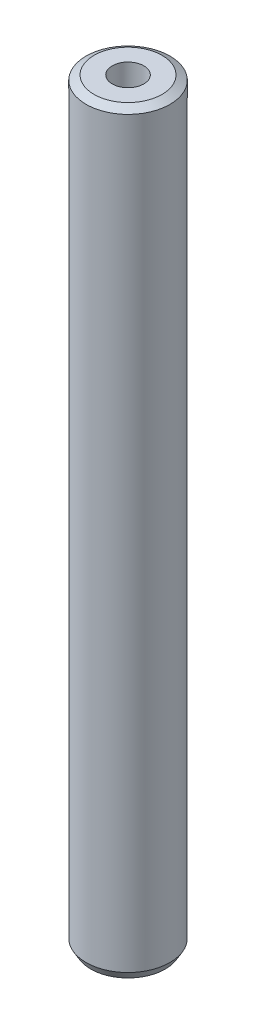
ISO-10303-21;
HEADER;
FILE_DESCRIPTION(('STEP AP214'),'2;1');
FILE_NAME('part.step','',(''),(''),'','','');
FILE_SCHEMA(('AUTOMOTIVE_DESIGN { 1 0 10303 214 1 1 1 1 }'));
ENDSEC;
DATA;
#1=APPLICATION_CONTEXT('core data for automotive mechanical design processes');
#2=APPLICATION_PROTOCOL_DEFINITION('international standard','automotive_design',2000,#1);
#3=PRODUCT_CONTEXT('',#1,'mechanical');
#4=PRODUCT('Part','Part','',(#3));
#5=PRODUCT_RELATED_PRODUCT_CATEGORY('part','',(#4));
#6=PRODUCT_DEFINITION_FORMATION('','',#4);
#7=PRODUCT_DEFINITION_CONTEXT('part definition',#1,'design');
#8=PRODUCT_DEFINITION('design','',#6,#7);
#9=PRODUCT_DEFINITION_SHAPE('','',#8);
#10=(LENGTH_UNIT() NAMED_UNIT(*) SI_UNIT(.MILLI.,.METRE.));
#11=(NAMED_UNIT(*) PLANE_ANGLE_UNIT() SI_UNIT($,.RADIAN.));
#12=(NAMED_UNIT(*) SI_UNIT($,.STERADIAN.) SOLID_ANGLE_UNIT());
#13=UNCERTAINTY_MEASURE_WITH_UNIT(LENGTH_MEASURE(1.E-05),#10,'distance_accuracy_value','');
#14=(GEOMETRIC_REPRESENTATION_CONTEXT(3) GLOBAL_UNCERTAINTY_ASSIGNED_CONTEXT((#13)) GLOBAL_UNIT_ASSIGNED_CONTEXT((#10,
#11,#12)) REPRESENTATION_CONTEXT('',''));
#15=CARTESIAN_POINT('',(0.,0.,0.));
#16=DIRECTION('',(0.,0.,1.));
#17=DIRECTION('',(1.,0.,0.));
#18=AXIS2_PLACEMENT_3D('',#15,#16,#17);
#19=CARTESIAN_POINT('',(0.,180.282610110916,0.));
#20=DIRECTION('',(0.,-1.,0.));
#21=DIRECTION('',(0.,0.,-1.));
#22=AXIS2_PLACEMENT_3D('',#19,#20,#21);
#23=CYLINDRICAL_SURFACE('',#22,10.);
#24=CARTESIAN_POINT('',(0.,179.183587360604,0.));
#25=DIRECTION('',(0.,1.,0.));
#26=DIRECTION('',(0.,0.,1.));
#27=AXIS2_PLACEMENT_3D('',#24,#25,#26);
#28=CIRCLE('',#27,10.);
#29=CARTESIAN_POINT('',(0.,179.183587360604,-10.));
#30=VERTEX_POINT('',#29);
#31=EDGE_CURVE('E50',#30,#30,#28,.F.);
#32=CARTESIAN_POINT('',(0.,1.9035632422148,0.));
#33=DIRECTION('',(0.,1.,0.));
#34=DIRECTION('',(0.,0.,1.));
#35=AXIS2_PLACEMENT_3D('',#32,#33,#34);
#36=CIRCLE('',#35,10.);
#37=CARTESIAN_POINT('',(0.,1.9035632422148,-10.));
#38=VERTEX_POINT('',#37);
#39=EDGE_CURVE('E51',#38,#38,#36,.T.);
#40=CARTESIAN_POINT('',(0.,179.183587360604,-10.));
#41=CARTESIAN_POINT('',(0.,177.336920442704,-10.));
#42=CARTESIAN_POINT('',(0.,175.490253524804,-10.));
#43=CARTESIAN_POINT('',(0.,171.796919689005,-10.));
#44=CARTESIAN_POINT('',(0.,169.950252771105,-10.));
#45=CARTESIAN_POINT('',(0.,166.256918935305,-10.));
#46=CARTESIAN_POINT('',(0.,164.410252017405,-10.));
#47=CARTESIAN_POINT('',(0.,160.716918181605,-10.));
#48=CARTESIAN_POINT('',(0.,158.870251263705,-10.));
#49=CARTESIAN_POINT('',(0.,155.176917427906,-10.));
#50=CARTESIAN_POINT('',(0.,153.330250510006,-10.));
#51=CARTESIAN_POINT('',(0.,149.636916674206,-10.));
#52=CARTESIAN_POINT('',(0.,147.790249756306,-10.));
#53=CARTESIAN_POINT('',(0.,144.096915920506,-10.));
#54=CARTESIAN_POINT('',(0.,142.250249002606,-10.));
#55=CARTESIAN_POINT('',(0.,138.556915166807,-10.));
#56=CARTESIAN_POINT('',(0.,136.710248248907,-10.));
#57=CARTESIAN_POINT('',(0.,133.016914413107,-10.));
#58=CARTESIAN_POINT('',(0.,131.170247495207,-10.));
#59=CARTESIAN_POINT('',(0.,127.476913659407,-10.));
#60=CARTESIAN_POINT('',(0.,125.630246741507,-10.));
#61=CARTESIAN_POINT('',(0.,121.936912905708,-10.));
#62=CARTESIAN_POINT('',(0.,120.090245987808,-10.));
#63=CARTESIAN_POINT('',(0.,116.396912152008,-10.));
#64=CARTESIAN_POINT('',(0.,114.550245234108,-10.));
#65=CARTESIAN_POINT('',(0.,110.856911398308,-10.));
#66=CARTESIAN_POINT('',(0.,109.010244480408,-10.));
#67=CARTESIAN_POINT('',(0.,105.316910644609,-10.));
#68=CARTESIAN_POINT('',(0.,103.470243726709,-10.));
#69=CARTESIAN_POINT('',(0.,99.7769098909089,-10.));
#70=CARTESIAN_POINT('',(0.,97.930242973009,-10.));
#71=CARTESIAN_POINT('',(0.,94.2369091372092,-10.));
#72=CARTESIAN_POINT('',(0.,92.3902422193093,-10.));
#73=CARTESIAN_POINT('',(0.,88.6969083835096,-10.));
#74=CARTESIAN_POINT('',(0.,86.8502414656097,-10.));
#75=CARTESIAN_POINT('',(0.,83.1569076298099,-10.));
#76=CARTESIAN_POINT('',(0.,81.31024071191,-10.));
#77=CARTESIAN_POINT('',(0.,77.6169068761102,-10.));
#78=CARTESIAN_POINT('',(0.,75.7702399582103,-10.));
#79=CARTESIAN_POINT('',(0.,72.0769061224105,-10.));
#80=CARTESIAN_POINT('',(0.,70.2302392045107,-10.));
#81=CARTESIAN_POINT('',(0.,66.5369053687109,-10.));
#82=CARTESIAN_POINT('',(0.,64.690238450811,-10.));
#83=CARTESIAN_POINT('',(0.,60.9969046150112,-10.));
#84=CARTESIAN_POINT('',(0.,59.1502376971113,-10.));
#85=CARTESIAN_POINT('',(0.,55.4569038613116,-10.));
#86=CARTESIAN_POINT('',(0.,53.6102369434117,-10.));
#87=CARTESIAN_POINT('',(0.,49.9169031076119,-10.));
#88=CARTESIAN_POINT('',(0.,48.070236189712,-10.));
#89=CARTESIAN_POINT('',(0.,44.3769023539122,-10.));
#90=CARTESIAN_POINT('',(0.,42.5302354360123,-10.));
#91=CARTESIAN_POINT('',(0.,38.8369016002126,-10.));
#92=CARTESIAN_POINT('',(0.,36.9902346823127,-10.));
#93=CARTESIAN_POINT('',(0.,33.2969008465129,-10.));
#94=CARTESIAN_POINT('',(0.,31.450233928613,-10.));
#95=CARTESIAN_POINT('',(0.,27.7569000928132,-10.));
#96=CARTESIAN_POINT('',(0.,25.9102331749133,-10.));
#97=CARTESIAN_POINT('',(0.,22.2168993391136,-10.));
#98=CARTESIAN_POINT('',(0.,20.3702324212137,-10.));
#99=CARTESIAN_POINT('',(0.,16.6768985854139,-10.));
#100=CARTESIAN_POINT('',(0.,14.830231667514,-10.));
#101=CARTESIAN_POINT('',(0.,11.1368978317142,-10.));
#102=CARTESIAN_POINT('',(0.,9.29023091381436,-10.));
#103=CARTESIAN_POINT('',(0.,5.59689707801458,-10.));
#104=CARTESIAN_POINT('',(0.,3.75023016011469,-10.));
#105=CARTESIAN_POINT('',(0.,1.9035632422148,-10.));
#106=B_SPLINE_CURVE_WITH_KNOTS('',3,(#40,#41,#42,#43,#44,#45,#46,#47,#48,#49,#50,#51,#52,#53,
#54,#55,#56,#57,#58,#59,#60,#61,#62,#63,#64,#65,#66,#67,#68,#69,#70,#71,#72,#73,#74,#75,#76,#77,
#78,#79,#80,#81,#82,#83,#84,#85,#86,#87,#88,#89,#90,#91,#92,#93,#94,#95,#96,#97,#98,#99,#100,
#101,#102,#103,#104,#105),.UNSPECIFIED.,.F.,.F.,(4,2,2,2,2,2,2,2,2,2,2,2,2,2,2,2,2,2,2,2,2,2,2,
2,2,2,2,2,2,2,2,2,4),(0.,5.54000075369965,11.0800015073993,16.620002261099,22.1600030147986,
27.7000037684983,33.240004522198,38.7800052758976,44.3200060295973,49.860006783297,
55.4000075369966,60.9400082906963,66.480009044396,72.0200097980956,77.5600105517953,
83.1000113054949,88.6400120591946,94.1800128128943,99.7200135665939,105.260014320294,
110.800015073993,116.340015827693,121.880016581393,127.420017335092,132.960018088792,
138.500018842492,144.040019596191,149.580020349891,155.120021103591,160.66002185729,
166.20002261099,171.74002336469,177.280024118389),.UNSPECIFIED.);
#107=EDGE_CURVE('BSEAM39',#30,#38,#106,.T.);
#108=ORIENTED_EDGE('',*,*,#31,.T.);
#109=ORIENTED_EDGE('',*,*,#39,.T.);
#110=ORIENTED_EDGE('',*,*,#107,.T.);
#111=ORIENTED_EDGE('',*,*,#107,.F.);
#112=EDGE_LOOP('',(#108,#110,#109,#111));
#113=FACE_BOUND('',#112,.T.);
#114=ADVANCED_FACE('F39',(#113),#23,.T.);
#115=CARTESIAN_POINT('',(0.,180.282610110916,0.));
#116=DIRECTION('',(0.,1.,0.));
#117=DIRECTION('',(0.,0.,1.));
#118=AXIS2_PLACEMENT_3D('',#115,#116,#117);
#119=PLANE('',#118);
#120=CARTESIAN_POINT('',(0.,180.282610110916,0.));
#121=DIRECTION('',(0.,1.,0.));
#122=DIRECTION('',(0.,0.,1.));
#123=AXIS2_PLACEMENT_3D('',#120,#121,#122);
#124=CIRCLE('',#123,8.09643675778579);
#125=CARTESIAN_POINT('',(0.,180.282610110916,8.09643675778579));
#126=VERTEX_POINT('',#125);
#127=EDGE_CURVE('E54',#126,#126,#124,.T.);
#128=ORIENTED_EDGE('',*,*,#127,.T.);
#129=EDGE_LOOP('',(#128));
#130=FACE_BOUND('',#129,.T.);
#131=CARTESIAN_POINT('',(0.,180.282610110916,0.));
#132=DIRECTION('',(0.,1.,0.));
#133=DIRECTION('',(0.,0.,1.));
#134=AXIS2_PLACEMENT_3D('',#131,#132,#133);
#135=CIRCLE('',#134,3.75968000644299);
#136=CARTESIAN_POINT('',(0.,180.282610110916,-3.75968000644299));
#137=VERTEX_POINT('',#136);
#138=EDGE_CURVE('E58',#137,#137,#135,.T.);
#139=ORIENTED_EDGE('',*,*,#138,.F.);
#140=EDGE_LOOP('',(#139));
#141=FACE_BOUND('',#140,.T.);
#142=ADVANCED_FACE('F69',(#130,#141),#119,.T.);
#143=CARTESIAN_POINT('',(0.,0.,0.));
#144=DIRECTION('',(0.,1.,0.));
#145=DIRECTION('',(0.,0.,1.));
#146=AXIS2_PLACEMENT_3D('',#143,#144,#145);
#147=PLANE('',#146);
#148=CARTESIAN_POINT('',(0.,0.,0.));
#149=DIRECTION('',(0.,1.,0.));
#150=DIRECTION('',(0.,0.,1.));
#151=AXIS2_PLACEMENT_3D('',#148,#149,#150);
#152=CIRCLE('',#151,8.9009772496878);
#153=CARTESIAN_POINT('',(0.,0.,8.9009772496878));
#154=VERTEX_POINT('',#153);
#155=EDGE_CURVE('E10',#154,#154,#152,.F.);
#156=ORIENTED_EDGE('',*,*,#155,.T.);
#157=EDGE_LOOP('',(#156));
#158=FACE_BOUND('',#157,.T.);
#159=CARTESIAN_POINT('',(0.,0.,0.));
#160=DIRECTION('',(0.,1.,0.));
#161=DIRECTION('',(0.,0.,1.));
#162=AXIS2_PLACEMENT_3D('',#159,#160,#161);
#163=CIRCLE('',#162,3.75968000644299);
#164=CARTESIAN_POINT('',(0.,0.,-3.75968000644299));
#165=VERTEX_POINT('',#164);
#166=EDGE_CURVE('E63',#165,#165,#163,.T.);
#167=ORIENTED_EDGE('',*,*,#166,.T.);
#168=EDGE_LOOP('',(#167));
#169=FACE_BOUND('',#168,.T.);
#170=ADVANCED_FACE('F75',(#158,#169),#147,.F.);
#171=CARTESIAN_POINT('',(0.,180.282610110916,0.));
#172=DIRECTION('',(0.,-1.,0.));
#173=DIRECTION('',(0.,0.,-1.));
#174=AXIS2_PLACEMENT_3D('',#171,#172,#173);
#175=CYLINDRICAL_SURFACE('',#174,3.75968000644299);
#176=CARTESIAN_POINT('',(0.,180.282610110916,-3.75968000644299));
#177=CARTESIAN_POINT('',(0.,178.404666255594,-3.75968000644299));
#178=CARTESIAN_POINT('',(0.,176.526722400272,-3.75968000644299));
#179=CARTESIAN_POINT('',(0.,172.770834689628,-3.75968000644299));
#180=CARTESIAN_POINT('',(0.,170.892890834306,-3.75968000644299));
#181=CARTESIAN_POINT('',(0.,167.137003123662,-3.75968000644299));
#182=CARTESIAN_POINT('',(0.,165.25905926834,-3.75968000644299));
#183=CARTESIAN_POINT('',(0.,161.503171557696,-3.75968000644299));
#184=CARTESIAN_POINT('',(0.,159.625227702373,-3.75968000644299));
#185=CARTESIAN_POINT('',(0.,155.869339991729,-3.75968000644299));
#186=CARTESIAN_POINT('',(0.,153.991396136407,-3.75968000644299));
#187=CARTESIAN_POINT('',(0.,150.235508425763,-3.75968000644299));
#188=CARTESIAN_POINT('',(0.,148.357564570441,-3.75968000644299));
#189=CARTESIAN_POINT('',(0.,144.601676859797,-3.75968000644299));
#190=CARTESIAN_POINT('',(0.,142.723733004475,-3.75968000644299));
#191=CARTESIAN_POINT('',(0.,138.967845293831,-3.75968000644299));
#192=CARTESIAN_POINT('',(0.,137.089901438509,-3.75968000644299));
#193=CARTESIAN_POINT('',(0.,133.334013727865,-3.75968000644299));
#194=CARTESIAN_POINT('',(0.,131.456069872543,-3.75968000644299));
#195=CARTESIAN_POINT('',(0.,127.700182161899,-3.75968000644299));
#196=CARTESIAN_POINT('',(0.,125.822238306577,-3.75968000644299));
#197=CARTESIAN_POINT('',(0.,122.066350595933,-3.75968000644299));
#198=CARTESIAN_POINT('',(0.,120.188406740611,-3.75968000644299));
#199=CARTESIAN_POINT('',(0.,116.432519029967,-3.75968000644299));
#200=CARTESIAN_POINT('',(0.,114.554575174644,-3.75968000644299));
#201=CARTESIAN_POINT('',(0.,110.798687464,-3.75968000644299));
#202=CARTESIAN_POINT('',(0.,108.920743608678,-3.75968000644299));
#203=CARTESIAN_POINT('',(0.,105.164855898034,-3.75968000644299));
#204=CARTESIAN_POINT('',(0.,103.286912042712,-3.75968000644299));
#205=CARTESIAN_POINT('',(0.,99.5310243320682,-3.75968000644299));
#206=CARTESIAN_POINT('',(0.,97.6530804767461,-3.75968000644299));
#207=CARTESIAN_POINT('',(0.,93.8971927661021,-3.75968000644299));
#208=CARTESIAN_POINT('',(0.,92.01924891078,-3.75968000644299));
#209=CARTESIAN_POINT('',(0.,88.2633612001359,-3.75968000644299));
#210=CARTESIAN_POINT('',(0.,86.3854173448139,-3.75968000644299));
#211=CARTESIAN_POINT('',(0.,82.6295296341698,-3.75968000644299));
#212=CARTESIAN_POINT('',(0.,80.7515857788478,-3.75968000644299));
#213=CARTESIAN_POINT('',(0.,76.9956980682037,-3.75968000644299));
#214=CARTESIAN_POINT('',(0.,75.1177542128816,-3.75968000644299));
#215=CARTESIAN_POINT('',(0.,71.3618665022375,-3.75968000644299));
#216=CARTESIAN_POINT('',(0.,69.4839226469155,-3.75968000644299));
#217=CARTESIAN_POINT('',(0.,65.7280349362714,-3.75968000644299));
#218=CARTESIAN_POINT('',(0.,63.8500910809494,-3.75968000644299));
#219=CARTESIAN_POINT('',(0.,60.0942033703053,-3.75968000644299));
#220=CARTESIAN_POINT('',(0.,58.2162595149833,-3.75968000644299));
#221=CARTESIAN_POINT('',(0.,54.4603718043392,-3.75968000644299));
#222=CARTESIAN_POINT('',(0.,52.5824279490171,-3.75968000644299));
#223=CARTESIAN_POINT('',(0.,48.8265402383731,-3.75968000644299));
#224=CARTESIAN_POINT('',(0.,46.948596383051,-3.75968000644299));
#225=CARTESIAN_POINT('',(0.,43.1927086724069,-3.75968000644299));
#226=CARTESIAN_POINT('',(0.,41.3147648170849,-3.75968000644299));
#227=CARTESIAN_POINT('',(0.,37.5588771064408,-3.75968000644299));
#228=CARTESIAN_POINT('',(0.,35.6809332511188,-3.75968000644299));
#229=CARTESIAN_POINT('',(0.,31.9250455404747,-3.75968000644299));
#230=CARTESIAN_POINT('',(0.,30.0471016851527,-3.75968000644299));
#231=CARTESIAN_POINT('',(0.,26.2912139745086,-3.75968000644299));
#232=CARTESIAN_POINT('',(0.,24.4132701191865,-3.75968000644299));
#233=CARTESIAN_POINT('',(0.,20.6573824085424,-3.75968000644299));
#234=CARTESIAN_POINT('',(0.,18.7794385532204,-3.75968000644299));
#235=CARTESIAN_POINT('',(0.,15.0235508425763,-3.75968000644299));
#236=CARTESIAN_POINT('',(0.,13.1456069872543,-3.75968000644299));
#237=CARTESIAN_POINT('',(0.,9.38971927661021,-3.75968000644299));
#238=CARTESIAN_POINT('',(0.,7.51177542128816,-3.75968000644299));
#239=CARTESIAN_POINT('',(0.,3.75588771064408,-3.75968000644299));
#240=CARTESIAN_POINT('',(0.,1.87794385532204,-3.75968000644299));
#241=CARTESIAN_POINT('',(0.,0.,-3.75968000644299));
#242=B_SPLINE_CURVE_WITH_KNOTS('',3,(#176,#177,#178,#179,#180,#181,#182,#183,#184,#185,#186,
#187,#188,#189,#190,#191,#192,#193,#194,#195,#196,#197,#198,#199,#200,#201,#202,#203,#204,#205,
#206,#207,#208,#209,#210,#211,#212,#213,#214,#215,#216,#217,#218,#219,#220,#221,#222,#223,#224,
#225,#226,#227,#228,#229,#230,#231,#232,#233,#234,#235,#236,#237,#238,#239,#240,#241),
.UNSPECIFIED.,.F.,.F.,(4,2,2,2,2,2,2,2,2,2,2,2,2,2,2,2,2,2,2,2,2,2,2,2,2,2,2,2,2,2,2,2,4),(0.,
5.63383156596611,11.2676631319322,16.9014946978983,22.5353262638645,28.1691578298306,
33.8029893957967,39.4368209617628,45.070652527729,50.7044840936951,56.3383156596612,
61.9721472256273,67.6059787915934,73.2398103575596,78.8736419235257,84.5074734894918,
90.1413050554579,95.7751366214241,101.40896818739,107.042799753356,112.676631319322,
118.310462885289,123.944294451255,129.578126017221,135.211957583187,140.845789149153,
146.479620715119,152.113452281085,157.747283847051,163.381115413018,169.014946978984,
174.64877854495,180.282610110916),.UNSPECIFIED.);
#243=EDGE_CURVE('BSEAM70',#137,#165,#242,.T.);
#244=ORIENTED_EDGE('',*,*,#138,.T.);
#245=ORIENTED_EDGE('',*,*,#166,.F.);
#246=ORIENTED_EDGE('',*,*,#243,.T.);
#247=ORIENTED_EDGE('',*,*,#243,.F.);
#248=EDGE_LOOP('',(#244,#246,#245,#247));
#249=FACE_BOUND('',#248,.T.);
#250=ADVANCED_FACE('F70',(#249),#175,.F.);
#251=CARTESIAN_POINT('',(0.,180.282610110916,0.));
#252=DIRECTION('',(0.,-1.,0.));
#253=DIRECTION('',(0.,0.,-1.));
#254=AXIS2_PLACEMENT_3D('',#251,#252,#253);
#255=CONICAL_SURFACE('',#254,8.09643675778579,1.0471975511966);
#256=ORIENTED_EDGE('',*,*,#31,.F.);
#257=EDGE_LOOP('',(#256));
#258=FACE_BOUND('',#257,.T.);
#259=ORIENTED_EDGE('',*,*,#127,.F.);
#260=EDGE_LOOP('',(#259));
#261=FACE_BOUND('',#260,.T.);
#262=ADVANCED_FACE('F81',(#258,#261),#255,.T.);
#263=CARTESIAN_POINT('',(0.,1.9035632422148,0.));
#264=DIRECTION('',(0.,1.,0.));
#265=DIRECTION('',(0.,0.,1.));
#266=AXIS2_PLACEMENT_3D('',#263,#264,#265);
#267=CONICAL_SURFACE('',#266,10.,0.523598775598302);
#268=ORIENTED_EDGE('',*,*,#155,.F.);
#269=EDGE_LOOP('',(#268));
#270=FACE_BOUND('',#269,.T.);
#271=ORIENTED_EDGE('',*,*,#39,.F.);
#272=EDGE_LOOP('',(#271));
#273=FACE_BOUND('',#272,.T.);
#274=ADVANCED_FACE('F45',(#270,#273),#267,.T.);
#275=CLOSED_SHELL('',(#114,#142,#170,#250,#262,#274));
#276=MANIFOLD_SOLID_BREP('B2',#275);
#277=ADVANCED_BREP_SHAPE_REPRESENTATION('',(#18,#276),#14);
#278=SHAPE_DEFINITION_REPRESENTATION(#9,#277);
ENDSEC;
END-ISO-10303-21;
